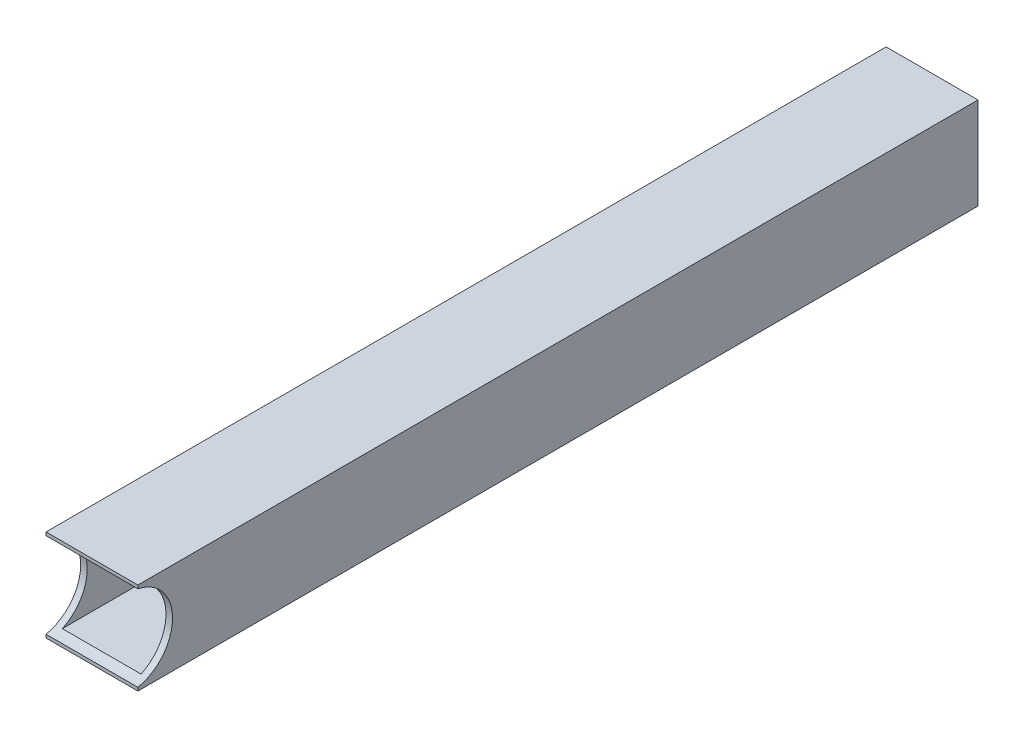
ISO-10303-21;
HEADER;
FILE_DESCRIPTION(('STEP AP214'),'2;1');
FILE_NAME('part.step','',(''),(''),'','','');
FILE_SCHEMA(('AUTOMOTIVE_DESIGN { 1 0 10303 214 1 1 1 1 }'));
ENDSEC;
DATA;
#1=APPLICATION_CONTEXT('core data for automotive mechanical design processes');
#2=APPLICATION_PROTOCOL_DEFINITION('international standard','automotive_design',2000,#1);
#3=PRODUCT_CONTEXT('',#1,'mechanical');
#4=PRODUCT('Part','Part','',(#3));
#5=PRODUCT_RELATED_PRODUCT_CATEGORY('part','',(#4));
#6=PRODUCT_DEFINITION_FORMATION('','',#4);
#7=PRODUCT_DEFINITION_CONTEXT('part definition',#1,'design');
#8=PRODUCT_DEFINITION('design','',#6,#7);
#9=PRODUCT_DEFINITION_SHAPE('','',#8);
#10=(LENGTH_UNIT() NAMED_UNIT(*) SI_UNIT(.MILLI.,.METRE.));
#11=(NAMED_UNIT(*) PLANE_ANGLE_UNIT() SI_UNIT($,.RADIAN.));
#12=(NAMED_UNIT(*) SI_UNIT($,.STERADIAN.) SOLID_ANGLE_UNIT());
#13=UNCERTAINTY_MEASURE_WITH_UNIT(LENGTH_MEASURE(1.E-05),#10,'distance_accuracy_value','');
#14=(GEOMETRIC_REPRESENTATION_CONTEXT(3) GLOBAL_UNCERTAINTY_ASSIGNED_CONTEXT((#13)) GLOBAL_UNIT_ASSIGNED_CONTEXT((#10,
#11,#12)) REPRESENTATION_CONTEXT('',''));
#15=CARTESIAN_POINT('',(0.,0.,0.));
#16=DIRECTION('',(0.,0.,1.));
#17=DIRECTION('',(1.,0.,0.));
#18=AXIS2_PLACEMENT_3D('',#15,#16,#17);
#19=CARTESIAN_POINT('',(0.,-22.225,450.85));
#20=DIRECTION('',(0.,0.,1.));
#21=DIRECTION('',(1.,0.,0.));
#22=AXIS2_PLACEMENT_3D('',#19,#20,#21);
#23=PLANE('',#22);
#24=DIRECTION('',(1.,0.,0.));
#25=VECTOR('',#24,1.);
#26=CARTESIAN_POINT('',(0.,0.,450.85));
#27=LINE('',#26,#25);
#28=CARTESIAN_POINT('',(704.85,0.,450.85));
#29=VERTEX_POINT('',#28);
#30=CARTESIAN_POINT('',(660.4,0.,450.85));
#31=VERTEX_POINT('',#30);
#32=EDGE_CURVE('E114',#29,#31,#27,.F.);
#33=ORIENTED_EDGE('',*,*,#32,.T.);
#34=DIRECTION('',(0.,1.,0.));
#35=VECTOR('',#34,1.);
#36=CARTESIAN_POINT('',(660.4,-22.225,450.85));
#37=LINE('',#36,#35);
#38=CARTESIAN_POINT('',(660.4,-1.58994245222467,450.85));
#39=VERTEX_POINT('',#38);
#40=EDGE_CURVE('E119',#31,#39,#37,.F.);
#41=ORIENTED_EDGE('',*,*,#40,.T.);
#42=DIRECTION('',(-1.,0.,0.));
#43=VECTOR('',#42,1.);
#44=CARTESIAN_POINT('',(660.398,-1.58994245222467,450.85));
#45=LINE('',#44,#43);
#46=CARTESIAN_POINT('',(704.85,-1.58994245222467,450.85));
#47=VERTEX_POINT('',#46);
#48=EDGE_CURVE('E102',#39,#47,#45,.F.);
#49=ORIENTED_EDGE('',*,*,#48,.T.);
#50=DIRECTION('',(0.,1.,0.));
#51=VECTOR('',#50,1.);
#52=CARTESIAN_POINT('',(704.85,-22.225,450.85));
#53=LINE('',#52,#51);
#54=EDGE_CURVE('E121',#47,#29,#53,.T.);
#55=ORIENTED_EDGE('',*,*,#54,.T.);
#56=EDGE_LOOP('',(#33,#41,#49,#55));
#57=FACE_BOUND('',#56,.T.);
#58=ADVANCED_FACE('F14',(#57),#23,.T.);
#59=CARTESIAN_POINT('',(0.,-3.175,450.85));
#60=DIRECTION('',(0.,-1.,0.));
#61=DIRECTION('',(0.,0.,-1.));
#62=AXIS2_PLACEMENT_3D('',#59,#60,#61);
#63=PLANE('',#62);
#64=DIRECTION('',(1.,0.,0.));
#65=VECTOR('',#64,1.);
#66=CARTESIAN_POINT('',(0.,-3.175,44.45));
#67=LINE('',#66,#65);
#68=CARTESIAN_POINT('',(663.575,-3.175,44.45));
#69=VERTEX_POINT('',#68);
#70=CARTESIAN_POINT('',(701.675,-3.175,44.45));
#71=VERTEX_POINT('',#70);
#72=EDGE_CURVE('E132',#69,#71,#67,.T.);
#73=ORIENTED_EDGE('',*,*,#72,.T.);
#74=DIRECTION('',(0.,0.,-1.));
#75=VECTOR('',#74,1.);
#76=CARTESIAN_POINT('',(701.675,-3.175,450.85));
#77=LINE('',#76,#75);
#78=CARTESIAN_POINT('',(701.675,-3.17499999999988,446.137594472008));
#79=VERTEX_POINT('',#78);
#80=EDGE_CURVE('E116',#71,#79,#77,.F.);
#81=ORIENTED_EDGE('',*,*,#80,.T.);
#82=DIRECTION('',(-1.,0.,0.));
#83=VECTOR('',#82,1.);
#84=CARTESIAN_POINT('',(660.398,-3.17499999999975,446.137594472008));
#85=LINE('',#84,#83);
#86=CARTESIAN_POINT('',(663.575,-3.17499999999988,446.137594472008));
#87=VERTEX_POINT('',#86);
#88=EDGE_CURVE('E108',#79,#87,#85,.T.);
#89=ORIENTED_EDGE('',*,*,#88,.T.);
#90=DIRECTION('',(0.,0.,1.));
#91=VECTOR('',#90,1.);
#92=CARTESIAN_POINT('',(663.575,-3.175,450.85));
#93=LINE('',#92,#91);
#94=EDGE_CURVE('E81',#87,#69,#93,.F.);
#95=ORIENTED_EDGE('',*,*,#94,.T.);
#96=EDGE_LOOP('',(#73,#81,#89,#95));
#97=FACE_BOUND('',#96,.T.);
#98=ADVANCED_FACE('F203',(#97),#63,.T.);
#99=CARTESIAN_POINT('',(701.675,-22.225,450.85));
#100=DIRECTION('',(1.,0.,0.));
#101=DIRECTION('',(0.,0.,-1.));
#102=AXIS2_PLACEMENT_3D('',#99,#100,#101);
#103=PLANE('',#102);
#104=CARTESIAN_POINT('',(701.675,-22.225,455.168));
#105=DIRECTION('',(-1.,0.,0.));
#106=DIRECTION('',(0.,0.,1.));
#107=AXIS2_PLACEMENT_3D('',#104,#105,#106);
#108=CIRCLE('',#107,21.082);
#109=CARTESIAN_POINT('',(701.675,-41.2750000000001,446.137594472008));
#110=VERTEX_POINT('',#109);
#111=EDGE_CURVE('E106',#110,#79,#108,.F.);
#112=ORIENTED_EDGE('',*,*,#111,.T.);
#113=ORIENTED_EDGE('',*,*,#80,.F.);
#114=DIRECTION('',(0.,1.,0.));
#115=VECTOR('',#114,1.);
#116=CARTESIAN_POINT('',(701.675,-22.225,44.45));
#117=LINE('',#116,#115);
#118=CARTESIAN_POINT('',(701.675,-41.275,44.45));
#119=VERTEX_POINT('',#118);
#120=EDGE_CURVE('E134',#71,#119,#117,.F.);
#121=ORIENTED_EDGE('',*,*,#120,.T.);
#122=DIRECTION('',(0.,0.,-1.));
#123=VECTOR('',#122,1.);
#124=CARTESIAN_POINT('',(701.675,-41.275,450.85));
#125=LINE('',#124,#123);
#126=EDGE_CURVE('E96',#119,#110,#125,.F.);
#127=ORIENTED_EDGE('',*,*,#126,.T.);
#128=EDGE_LOOP('',(#112,#113,#121,#127));
#129=FACE_BOUND('',#128,.T.);
#130=ADVANCED_FACE('F207',(#129),#103,.F.);
#131=CARTESIAN_POINT('',(0.,-41.275,450.85));
#132=DIRECTION('',(0.,-1.,0.));
#133=DIRECTION('',(0.,0.,-1.));
#134=AXIS2_PLACEMENT_3D('',#131,#132,#133);
#135=PLANE('',#134);
#136=DIRECTION('',(-1.,0.,0.));
#137=VECTOR('',#136,1.);
#138=CARTESIAN_POINT('',(660.398,-41.2750000000002,446.137594472008));
#139=LINE('',#138,#137);
#140=CARTESIAN_POINT('',(663.575,-41.2750000000001,446.137594472008));
#141=VERTEX_POINT('',#140);
#142=EDGE_CURVE('E91',#141,#110,#139,.F.);
#143=ORIENTED_EDGE('',*,*,#142,.T.);
#144=ORIENTED_EDGE('',*,*,#126,.F.);
#145=DIRECTION('',(1.,0.,0.));
#146=VECTOR('',#145,1.);
#147=CARTESIAN_POINT('',(0.,-41.275,44.45));
#148=LINE('',#147,#146);
#149=CARTESIAN_POINT('',(663.575,-41.275,44.45));
#150=VERTEX_POINT('',#149);
#151=EDGE_CURVE('E94',#119,#150,#148,.F.);
#152=ORIENTED_EDGE('',*,*,#151,.T.);
#153=DIRECTION('',(0.,0.,1.));
#154=VECTOR('',#153,1.);
#155=CARTESIAN_POINT('',(663.575,-41.275,450.85));
#156=LINE('',#155,#154);
#157=EDGE_CURVE('E87',#150,#141,#156,.T.);
#158=ORIENTED_EDGE('',*,*,#157,.T.);
#159=EDGE_LOOP('',(#143,#144,#152,#158));
#160=FACE_BOUND('',#159,.T.);
#161=ADVANCED_FACE('F88',(#160),#135,.F.);
#162=CARTESIAN_POINT('',(663.575,-22.225,450.85));
#163=DIRECTION('',(-1.,0.,0.));
#164=DIRECTION('',(0.,-1.,0.));
#165=AXIS2_PLACEMENT_3D('',#162,#163,#164);
#166=PLANE('',#165);
#167=CARTESIAN_POINT('',(663.575,-22.225,455.168));
#168=DIRECTION('',(-1.,0.,0.));
#169=DIRECTION('',(0.,0.,1.));
#170=AXIS2_PLACEMENT_3D('',#167,#168,#169);
#171=CIRCLE('',#170,21.082);
#172=EDGE_CURVE('E17',#87,#141,#171,.T.);
#173=ORIENTED_EDGE('',*,*,#172,.T.);
#174=ORIENTED_EDGE('',*,*,#157,.F.);
#175=DIRECTION('',(0.,1.,0.));
#176=VECTOR('',#175,1.);
#177=CARTESIAN_POINT('',(663.575,-22.225,44.45));
#178=LINE('',#177,#176);
#179=EDGE_CURVE('E127',#150,#69,#178,.T.);
#180=ORIENTED_EDGE('',*,*,#179,.T.);
#181=ORIENTED_EDGE('',*,*,#94,.F.);
#182=EDGE_LOOP('',(#173,#174,#180,#181));
#183=FACE_BOUND('',#182,.T.);
#184=ADVANCED_FACE('F99',(#183),#166,.F.);
#185=CARTESIAN_POINT('',(660.398,-22.225,455.168));
#186=DIRECTION('',(-1.,0.,0.));
#187=DIRECTION('',(0.,0.,1.));
#188=AXIS2_PLACEMENT_3D('',#185,#186,#187);
#189=CYLINDRICAL_SURFACE('',#188,21.082);
#190=ORIENTED_EDGE('',*,*,#111,.F.);
#191=ORIENTED_EDGE('',*,*,#142,.F.);
#192=ORIENTED_EDGE('',*,*,#172,.F.);
#193=ORIENTED_EDGE('',*,*,#88,.F.);
#194=EDGE_LOOP('',(#190,#191,#192,#193));
#195=FACE_BOUND('',#194,.T.);
#196=CARTESIAN_POINT('',(704.85,-22.225,455.168));
#197=DIRECTION('',(-1.,0.,0.));
#198=DIRECTION('',(0.,0.,1.));
#199=AXIS2_PLACEMENT_3D('',#196,#197,#198);
#200=CIRCLE('',#199,21.082);
#201=CARTESIAN_POINT('',(704.85,-42.8600575477754,450.85));
#202=VERTEX_POINT('',#201);
#203=EDGE_CURVE('E129',#47,#202,#200,.T.);
#204=ORIENTED_EDGE('',*,*,#203,.F.);
#205=ORIENTED_EDGE('',*,*,#48,.F.);
#206=CARTESIAN_POINT('',(660.4,-22.225,455.168));
#207=DIRECTION('',(-1.,0.,0.));
#208=DIRECTION('',(0.,0.,1.));
#209=AXIS2_PLACEMENT_3D('',#206,#207,#208);
#210=CIRCLE('',#209,21.082);
#211=CARTESIAN_POINT('',(660.4,-42.8600575477754,450.85));
#212=VERTEX_POINT('',#211);
#213=EDGE_CURVE('E152',#212,#39,#210,.F.);
#214=ORIENTED_EDGE('',*,*,#213,.F.);
#215=DIRECTION('',(1.,0.,0.));
#216=VECTOR('',#215,1.);
#217=CARTESIAN_POINT('',(0.,-42.8600575477754,450.85));
#218=LINE('',#217,#216);
#219=EDGE_CURVE('E158',#202,#212,#218,.F.);
#220=ORIENTED_EDGE('',*,*,#219,.F.);
#221=EDGE_LOOP('',(#204,#205,#214,#220));
#222=FACE_BOUND('',#221,.T.);
#223=ADVANCED_FACE('F103',(#195,#222),#189,.F.);
#224=CARTESIAN_POINT('',(0.,0.,450.85));
#225=DIRECTION('',(0.,-1.,0.));
#226=DIRECTION('',(0.,0.,-1.));
#227=AXIS2_PLACEMENT_3D('',#224,#225,#226);
#228=PLANE('',#227);
#229=DIRECTION('',(0.,0.,1.));
#230=VECTOR('',#229,1.);
#231=CARTESIAN_POINT('',(660.4,0.,450.85));
#232=LINE('',#231,#230);
#233=CARTESIAN_POINT('',(660.4,0.,44.45));
#234=VERTEX_POINT('',#233);
#235=EDGE_CURVE('E148',#31,#234,#232,.F.);
#236=ORIENTED_EDGE('',*,*,#235,.F.);
#237=ORIENTED_EDGE('',*,*,#32,.F.);
#238=DIRECTION('',(0.,0.,-1.));
#239=VECTOR('',#238,1.);
#240=CARTESIAN_POINT('',(704.85,0.,450.85));
#241=LINE('',#240,#239);
#242=CARTESIAN_POINT('',(704.85,0.,44.45));
#243=VERTEX_POINT('',#242);
#244=EDGE_CURVE('E155',#243,#29,#241,.F.);
#245=ORIENTED_EDGE('',*,*,#244,.F.);
#246=DIRECTION('',(1.,0.,0.));
#247=VECTOR('',#246,1.);
#248=CARTESIAN_POINT('',(0.,0.,44.45));
#249=LINE('',#248,#247);
#250=EDGE_CURVE('E135',#243,#234,#249,.F.);
#251=ORIENTED_EDGE('',*,*,#250,.T.);
#252=EDGE_LOOP('',(#236,#237,#245,#251));
#253=FACE_BOUND('',#252,.T.);
#254=ADVANCED_FACE('F213',(#253),#228,.F.);
#255=CARTESIAN_POINT('',(0.,-22.225,44.45));
#256=DIRECTION('',(0.,0.,1.));
#257=DIRECTION('',(1.,0.,0.));
#258=AXIS2_PLACEMENT_3D('',#255,#256,#257);
#259=PLANE('',#258);
#260=ORIENTED_EDGE('',*,*,#151,.F.);
#261=ORIENTED_EDGE('',*,*,#120,.F.);
#262=ORIENTED_EDGE('',*,*,#72,.F.);
#263=ORIENTED_EDGE('',*,*,#179,.F.);
#264=EDGE_LOOP('',(#260,#261,#262,#263));
#265=FACE_BOUND('',#264,.T.);
#266=ORIENTED_EDGE('',*,*,#250,.F.);
#267=DIRECTION('',(0.,1.,0.));
#268=VECTOR('',#267,1.);
#269=CARTESIAN_POINT('',(704.85,-22.225,44.45));
#270=LINE('',#269,#268);
#271=CARTESIAN_POINT('',(704.85,-44.45,44.45));
#272=VERTEX_POINT('',#271);
#273=EDGE_CURVE('E159',#272,#243,#270,.T.);
#274=ORIENTED_EDGE('',*,*,#273,.F.);
#275=DIRECTION('',(1.,0.,0.));
#276=VECTOR('',#275,1.);
#277=CARTESIAN_POINT('',(0.,-44.45,44.45));
#278=LINE('',#277,#276);
#279=CARTESIAN_POINT('',(660.4,-44.45,44.45));
#280=VERTEX_POINT('',#279);
#281=EDGE_CURVE('E194',#280,#272,#278,.T.);
#282=ORIENTED_EDGE('',*,*,#281,.F.);
#283=DIRECTION('',(0.,-1.,0.));
#284=VECTOR('',#283,1.);
#285=CARTESIAN_POINT('',(660.4,-22.225,44.45));
#286=LINE('',#285,#284);
#287=EDGE_CURVE('E151',#234,#280,#286,.T.);
#288=ORIENTED_EDGE('',*,*,#287,.F.);
#289=EDGE_LOOP('',(#266,#274,#282,#288));
#290=FACE_BOUND('',#289,.T.);
#291=ADVANCED_FACE('F209',(#265,#290),#259,.F.);
#292=CARTESIAN_POINT('',(704.85,-22.225,450.85));
#293=DIRECTION('',(1.,0.,0.));
#294=DIRECTION('',(0.,0.,-1.));
#295=AXIS2_PLACEMENT_3D('',#292,#293,#294);
#296=PLANE('',#295);
#297=ORIENTED_EDGE('',*,*,#244,.T.);
#298=ORIENTED_EDGE('',*,*,#54,.F.);
#299=ORIENTED_EDGE('',*,*,#203,.T.);
#300=DIRECTION('',(0.,1.,0.));
#301=VECTOR('',#300,1.);
#302=CARTESIAN_POINT('',(704.85,-22.225,450.85));
#303=LINE('',#302,#301);
#304=CARTESIAN_POINT('',(704.85,-44.45,450.85));
#305=VERTEX_POINT('',#304);
#306=EDGE_CURVE('E180',#305,#202,#303,.T.);
#307=ORIENTED_EDGE('',*,*,#306,.F.);
#308=DIRECTION('',(0.,0.,-1.));
#309=VECTOR('',#308,1.);
#310=CARTESIAN_POINT('',(704.85,-44.45,450.85));
#311=LINE('',#310,#309);
#312=EDGE_CURVE('E186',#272,#305,#311,.F.);
#313=ORIENTED_EDGE('',*,*,#312,.F.);
#314=ORIENTED_EDGE('',*,*,#273,.T.);
#315=EDGE_LOOP('',(#297,#298,#299,#307,#313,#314));
#316=FACE_BOUND('',#315,.T.);
#317=ADVANCED_FACE('F212',(#316),#296,.T.);
#318=CARTESIAN_POINT('',(0.,-22.225,450.85));
#319=DIRECTION('',(0.,0.,1.));
#320=DIRECTION('',(1.,0.,0.));
#321=AXIS2_PLACEMENT_3D('',#318,#319,#320);
#322=PLANE('',#321);
#323=DIRECTION('',(1.,0.,0.));
#324=VECTOR('',#323,1.);
#325=CARTESIAN_POINT('',(0.,-44.45,450.85));
#326=LINE('',#325,#324);
#327=CARTESIAN_POINT('',(660.4,-44.45,450.85));
#328=VERTEX_POINT('',#327);
#329=EDGE_CURVE('E23',#305,#328,#326,.F.);
#330=ORIENTED_EDGE('',*,*,#329,.F.);
#331=ORIENTED_EDGE('',*,*,#306,.T.);
#332=ORIENTED_EDGE('',*,*,#219,.T.);
#333=DIRECTION('',(0.,-1.,0.));
#334=VECTOR('',#333,1.);
#335=CARTESIAN_POINT('',(660.4,-22.225,450.85));
#336=LINE('',#335,#334);
#337=EDGE_CURVE('E32',#328,#212,#336,.F.);
#338=ORIENTED_EDGE('',*,*,#337,.F.);
#339=EDGE_LOOP('',(#330,#331,#332,#338));
#340=FACE_BOUND('',#339,.T.);
#341=ADVANCED_FACE('F226',(#340),#322,.T.);
#342=CARTESIAN_POINT('',(660.4,-22.225,450.85));
#343=DIRECTION('',(-1.,0.,0.));
#344=DIRECTION('',(0.,-1.,0.));
#345=AXIS2_PLACEMENT_3D('',#342,#343,#344);
#346=PLANE('',#345);
#347=ORIENTED_EDGE('',*,*,#287,.T.);
#348=DIRECTION('',(0.,0.,-1.));
#349=VECTOR('',#348,1.);
#350=CARTESIAN_POINT('',(660.4,-44.45,450.85));
#351=LINE('',#350,#349);
#352=EDGE_CURVE('E9',#328,#280,#351,.T.);
#353=ORIENTED_EDGE('',*,*,#352,.F.);
#354=ORIENTED_EDGE('',*,*,#337,.T.);
#355=ORIENTED_EDGE('',*,*,#213,.T.);
#356=ORIENTED_EDGE('',*,*,#40,.F.);
#357=ORIENTED_EDGE('',*,*,#235,.T.);
#358=EDGE_LOOP('',(#347,#353,#354,#355,#356,#357));
#359=FACE_BOUND('',#358,.T.);
#360=ADVANCED_FACE('F235',(#359),#346,.T.);
#361=CARTESIAN_POINT('',(0.,-44.45,450.85));
#362=DIRECTION('',(0.,-1.,0.));
#363=DIRECTION('',(0.,0.,-1.));
#364=AXIS2_PLACEMENT_3D('',#361,#362,#363);
#365=PLANE('',#364);
#366=ORIENTED_EDGE('',*,*,#329,.T.);
#367=ORIENTED_EDGE('',*,*,#352,.T.);
#368=ORIENTED_EDGE('',*,*,#281,.T.);
#369=ORIENTED_EDGE('',*,*,#312,.T.);
#370=EDGE_LOOP('',(#366,#367,#368,#369));
#371=FACE_BOUND('',#370,.T.);
#372=ADVANCED_FACE('F231',(#371),#365,.T.);
#373=CLOSED_SHELL('',(#58,#98,#130,#161,#184,#223,#254,#291,#317,#341,#360,#372));
#374=MANIFOLD_SOLID_BREP('B1',#373);
#375=ADVANCED_BREP_SHAPE_REPRESENTATION('',(#18,#374),#14);
#376=SHAPE_DEFINITION_REPRESENTATION(#9,#375);
ENDSEC;
END-ISO-10303-21;
